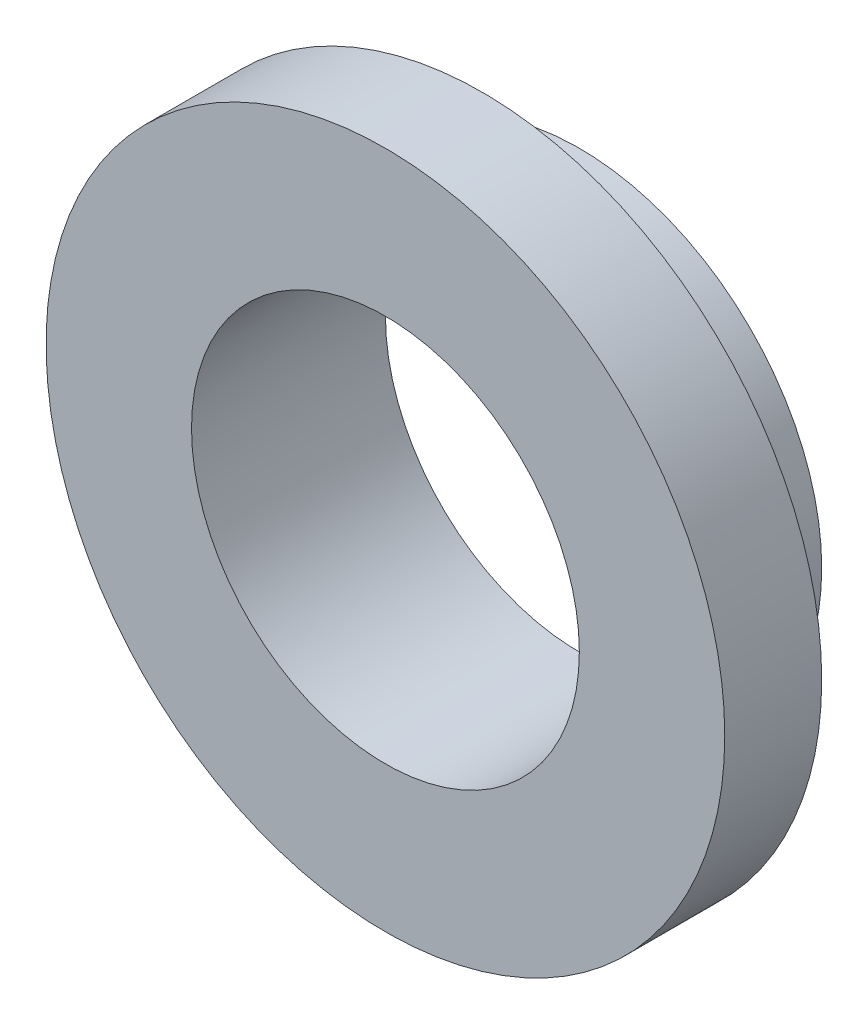
ISO-10303-21;
HEADER;
FILE_DESCRIPTION(('STEP AP214'),'2;1');
FILE_NAME('part.step','',(''),(''),'','','');
FILE_SCHEMA(('AUTOMOTIVE_DESIGN { 1 0 10303 214 1 1 1 1 }'));
ENDSEC;
DATA;
#1=APPLICATION_CONTEXT('core data for automotive mechanical design processes');
#2=APPLICATION_PROTOCOL_DEFINITION('international standard','automotive_design',2000,#1);
#3=PRODUCT_CONTEXT('',#1,'mechanical');
#4=PRODUCT('Part','Part','',(#3));
#5=PRODUCT_RELATED_PRODUCT_CATEGORY('part','',(#4));
#6=PRODUCT_DEFINITION_FORMATION('','',#4);
#7=PRODUCT_DEFINITION_CONTEXT('part definition',#1,'design');
#8=PRODUCT_DEFINITION('design','',#6,#7);
#9=PRODUCT_DEFINITION_SHAPE('','',#8);
#10=(LENGTH_UNIT() NAMED_UNIT(*) SI_UNIT(.MILLI.,.METRE.));
#11=(NAMED_UNIT(*) PLANE_ANGLE_UNIT() SI_UNIT($,.RADIAN.));
#12=(NAMED_UNIT(*) SI_UNIT($,.STERADIAN.) SOLID_ANGLE_UNIT());
#13=UNCERTAINTY_MEASURE_WITH_UNIT(LENGTH_MEASURE(1.E-05),#10,'distance_accuracy_value','');
#14=(GEOMETRIC_REPRESENTATION_CONTEXT(3) GLOBAL_UNCERTAINTY_ASSIGNED_CONTEXT((#13)) GLOBAL_UNIT_ASSIGNED_CONTEXT((#10,
#11,#12)) REPRESENTATION_CONTEXT('',''));
#15=CARTESIAN_POINT('',(0.,0.,0.));
#16=DIRECTION('',(0.,0.,1.));
#17=DIRECTION('',(1.,0.,0.));
#18=AXIS2_PLACEMENT_3D('',#15,#16,#17);
#19=CARTESIAN_POINT('',(0.,0.,1.));
#20=DIRECTION('',(0.,0.,-1.));
#21=DIRECTION('',(-1.,0.,0.));
#22=AXIS2_PLACEMENT_3D('',#19,#20,#21);
#23=CYLINDRICAL_SURFACE('',#22,2.5);
#24=CARTESIAN_POINT('',(0.,0.,-1.));
#25=DIRECTION('',(0.,0.,1.));
#26=DIRECTION('',(1.,0.,0.));
#27=AXIS2_PLACEMENT_3D('',#24,#25,#26);
#28=CIRCLE('',#27,2.5);
#29=CARTESIAN_POINT('',(2.5,0.,-1.));
#30=VERTEX_POINT('',#29);
#31=EDGE_CURVE('E34',#30,#30,#28,.T.);
#32=ORIENTED_EDGE('',*,*,#31,.T.);
#33=EDGE_LOOP('',(#32));
#34=FACE_BOUND('',#33,.T.);
#35=CARTESIAN_POINT('',(0.,0.,0.));
#36=DIRECTION('',(0.,0.,1.));
#37=DIRECTION('',(1.,0.,0.));
#38=AXIS2_PLACEMENT_3D('',#35,#36,#37);
#39=CIRCLE('',#38,2.5);
#40=CARTESIAN_POINT('',(2.5,0.,0.));
#41=VERTEX_POINT('',#40);
#42=EDGE_CURVE('E10',#41,#41,#39,.T.);
#43=ORIENTED_EDGE('',*,*,#42,.F.);
#44=EDGE_LOOP('',(#43));
#45=FACE_BOUND('',#44,.T.);
#46=ADVANCED_FACE('F31',(#34,#45),#23,.T.);
#47=CARTESIAN_POINT('',(0.,0.,1.));
#48=DIRECTION('',(0.,0.,1.));
#49=DIRECTION('',(1.,0.,0.));
#50=AXIS2_PLACEMENT_3D('',#47,#48,#49);
#51=PLANE('',#50);
#52=CARTESIAN_POINT('',(0.,0.,1.));
#53=DIRECTION('',(0.,0.,1.));
#54=DIRECTION('',(1.,0.,0.));
#55=AXIS2_PLACEMENT_3D('',#52,#53,#54);
#56=CIRCLE('',#55,2.);
#57=CARTESIAN_POINT('',(2.,0.,1.));
#58=VERTEX_POINT('',#57);
#59=EDGE_CURVE('E42',#58,#58,#56,.T.);
#60=ORIENTED_EDGE('',*,*,#59,.F.);
#61=EDGE_LOOP('',(#60));
#62=FACE_BOUND('',#61,.T.);
#63=CARTESIAN_POINT('',(0.,0.,1.));
#64=DIRECTION('',(0.,0.,1.));
#65=DIRECTION('',(1.,0.,0.));
#66=AXIS2_PLACEMENT_3D('',#63,#64,#65);
#67=CIRCLE('',#66,3.5);
#68=CARTESIAN_POINT('',(3.5,0.,1.));
#69=VERTEX_POINT('',#68);
#70=EDGE_CURVE('E45',#69,#69,#67,.T.);
#71=ORIENTED_EDGE('',*,*,#70,.T.);
#72=EDGE_LOOP('',(#71));
#73=FACE_BOUND('',#72,.T.);
#74=ADVANCED_FACE('F59',(#62,#73),#51,.T.);
#75=CARTESIAN_POINT('',(0.,0.,-1.));
#76=DIRECTION('',(0.,0.,1.));
#77=DIRECTION('',(1.,0.,0.));
#78=AXIS2_PLACEMENT_3D('',#75,#76,#77);
#79=PLANE('',#78);
#80=ORIENTED_EDGE('',*,*,#31,.F.);
#81=EDGE_LOOP('',(#80));
#82=FACE_BOUND('',#81,.T.);
#83=CARTESIAN_POINT('',(0.,0.,-1.));
#84=DIRECTION('',(0.,0.,1.));
#85=DIRECTION('',(1.,0.,0.));
#86=AXIS2_PLACEMENT_3D('',#83,#84,#85);
#87=CIRCLE('',#86,2.);
#88=CARTESIAN_POINT('',(2.,0.,-1.));
#89=VERTEX_POINT('',#88);
#90=EDGE_CURVE('E48',#89,#89,#87,.T.);
#91=ORIENTED_EDGE('',*,*,#90,.T.);
#92=EDGE_LOOP('',(#91));
#93=FACE_BOUND('',#92,.T.);
#94=ADVANCED_FACE('F79',(#82,#93),#79,.F.);
#95=CARTESIAN_POINT('',(0.,0.,1.));
#96=DIRECTION('',(0.,0.,-1.));
#97=DIRECTION('',(-1.,0.,0.));
#98=AXIS2_PLACEMENT_3D('',#95,#96,#97);
#99=CYLINDRICAL_SURFACE('',#98,2.);
#100=ORIENTED_EDGE('',*,*,#59,.T.);
#101=EDGE_LOOP('',(#100));
#102=FACE_BOUND('',#101,.T.);
#103=ORIENTED_EDGE('',*,*,#90,.F.);
#104=EDGE_LOOP('',(#103));
#105=FACE_BOUND('',#104,.T.);
#106=ADVANCED_FACE('F68',(#102,#105),#99,.F.);
#107=CARTESIAN_POINT('',(0.,0.,0.));
#108=DIRECTION('',(0.,0.,1.));
#109=DIRECTION('',(1.,0.,0.));
#110=AXIS2_PLACEMENT_3D('',#107,#108,#109);
#111=PLANE('',#110);
#112=CARTESIAN_POINT('',(0.,0.,0.));
#113=DIRECTION('',(0.,0.,1.));
#114=DIRECTION('',(1.,0.,0.));
#115=AXIS2_PLACEMENT_3D('',#112,#113,#114);
#116=CIRCLE('',#115,3.5);
#117=CARTESIAN_POINT('',(3.5,0.,0.));
#118=VERTEX_POINT('',#117);
#119=EDGE_CURVE('E50',#118,#118,#116,.T.);
#120=ORIENTED_EDGE('',*,*,#119,.F.);
#121=EDGE_LOOP('',(#120));
#122=FACE_BOUND('',#121,.T.);
#123=ORIENTED_EDGE('',*,*,#42,.T.);
#124=EDGE_LOOP('',(#123));
#125=FACE_BOUND('',#124,.T.);
#126=ADVANCED_FACE('F63',(#122,#125),#111,.F.);
#127=CARTESIAN_POINT('',(0.,0.,0.));
#128=DIRECTION('',(0.,0.,1.));
#129=DIRECTION('',(1.,0.,0.));
#130=AXIS2_PLACEMENT_3D('',#127,#128,#129);
#131=CYLINDRICAL_SURFACE('',#130,3.5);
#132=ORIENTED_EDGE('',*,*,#119,.T.);
#133=EDGE_LOOP('',(#132));
#134=FACE_BOUND('',#133,.T.);
#135=ORIENTED_EDGE('',*,*,#70,.F.);
#136=EDGE_LOOP('',(#135));
#137=FACE_BOUND('',#136,.T.);
#138=ADVANCED_FACE('F61',(#134,#137),#131,.T.);
#139=CLOSED_SHELL('',(#46,#74,#94,#106,#126,#138));
#140=MANIFOLD_SOLID_BREP('B2',#139);
#141=ADVANCED_BREP_SHAPE_REPRESENTATION('',(#18,#140),#14);
#142=SHAPE_DEFINITION_REPRESENTATION(#9,#141);
ENDSEC;
END-ISO-10303-21;
